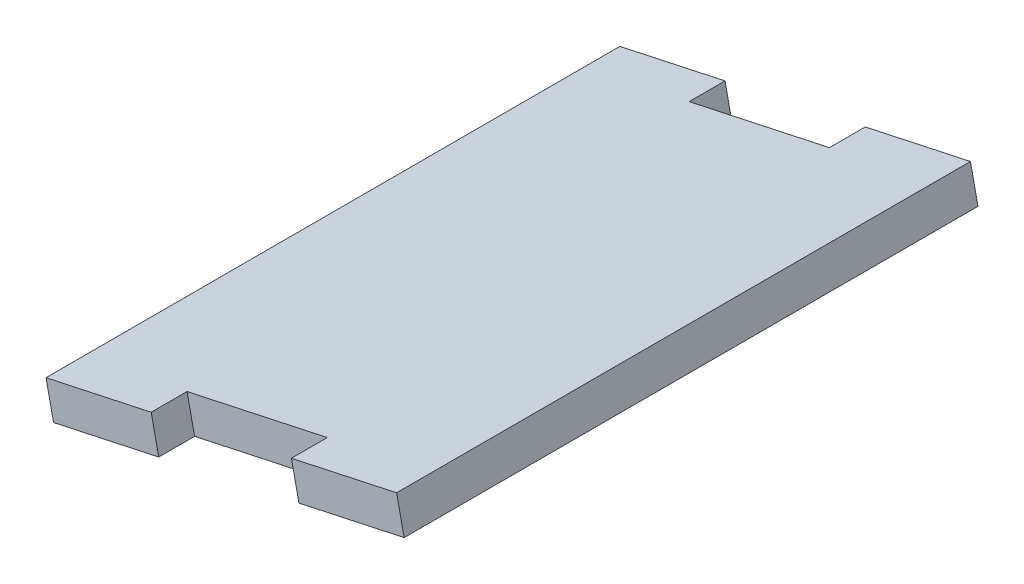
ISO-10303-21;
HEADER;
FILE_DESCRIPTION(('STEP AP214'),'2;1');
FILE_NAME('part.step','',(''),(''),'','','');
FILE_SCHEMA(('AUTOMOTIVE_DESIGN { 1 0 10303 214 1 1 1 1 }'));
ENDSEC;
DATA;
#1=APPLICATION_CONTEXT('core data for automotive mechanical design processes');
#2=APPLICATION_PROTOCOL_DEFINITION('international standard','automotive_design',2000,#1);
#3=PRODUCT_CONTEXT('',#1,'mechanical');
#4=PRODUCT('Part','Part','',(#3));
#5=PRODUCT_RELATED_PRODUCT_CATEGORY('part','',(#4));
#6=PRODUCT_DEFINITION_FORMATION('','',#4);
#7=PRODUCT_DEFINITION_CONTEXT('part definition',#1,'design');
#8=PRODUCT_DEFINITION('design','',#6,#7);
#9=PRODUCT_DEFINITION_SHAPE('','',#8);
#10=(LENGTH_UNIT() NAMED_UNIT(*) SI_UNIT(.MILLI.,.METRE.));
#11=(NAMED_UNIT(*) PLANE_ANGLE_UNIT() SI_UNIT($,.RADIAN.));
#12=(NAMED_UNIT(*) SI_UNIT($,.STERADIAN.) SOLID_ANGLE_UNIT());
#13=UNCERTAINTY_MEASURE_WITH_UNIT(LENGTH_MEASURE(1.E-05),#10,'distance_accuracy_value','');
#14=(GEOMETRIC_REPRESENTATION_CONTEXT(3) GLOBAL_UNCERTAINTY_ASSIGNED_CONTEXT((#13)) GLOBAL_UNIT_ASSIGNED_CONTEXT((#10,
#11,#12)) REPRESENTATION_CONTEXT('',''));
#15=CARTESIAN_POINT('',(0.,0.,0.));
#16=DIRECTION('',(0.,0.,1.));
#17=DIRECTION('',(1.,0.,0.));
#18=AXIS2_PLACEMENT_3D('',#15,#16,#17);
#19=CARTESIAN_POINT('',(0.,0.,0.));
#20=DIRECTION('',(0.,0.,1.));
#21=DIRECTION('',(1.,0.,0.));
#22=AXIS2_PLACEMENT_3D('',#19,#20,#21);
#23=PLANE('',#22);
#24=DIRECTION('',(-0.210873146354421,0.977513435276767,0.));
#25=VECTOR('',#24,1.);
#26=CARTESIAN_POINT('',(49.5443038822624,293.396684140525,0.));
#27=LINE('',#26,#25);
#28=CARTESIAN_POINT('',(49.5443038822624,293.396684140525,0.));
#29=VERTEX_POINT('',#28);
#30=CARTESIAN_POINT('',(48.8747816425871,296.500289297529,0.));
#31=VERTEX_POINT('',#30);
#32=EDGE_CURVE('E124',#29,#31,#27,.T.);
#33=ORIENTED_EDGE('',*,*,#32,.T.);
#34=DIRECTION('',(-0.977513435276767,-0.210873146354421,0.));
#35=VECTOR('',#34,1.);
#36=CARTESIAN_POINT('',(70.6000177416132,301.186944975256,0.));
#37=LINE('',#36,#35);
#38=CARTESIAN_POINT('',(39.5639661715759,294.491722578503,0.));
#39=VERTEX_POINT('',#38);
#40=EDGE_CURVE('E151',#31,#39,#37,.T.);
#41=ORIENTED_EDGE('',*,*,#40,.T.);
#42=DIRECTION('',(0.21087314635442,-0.977513435276768,0.));
#43=VECTOR('',#42,1.);
#44=CARTESIAN_POINT('',(39.5639661715759,294.491722578503,0.));
#45=LINE('',#44,#43);
#46=CARTESIAN_POINT('',(40.2334884112512,291.388117421499,0.));
#47=VERTEX_POINT('',#46);
#48=EDGE_CURVE('E146',#39,#47,#45,.T.);
#49=ORIENTED_EDGE('',*,*,#48,.T.);
#50=DIRECTION('',(0.977513435276767,0.21087314635442,0.));
#51=VECTOR('',#50,1.);
#52=CARTESIAN_POINT('',(40.2334884112512,291.388117421499,0.));
#53=LINE('',#52,#51);
#54=EDGE_CURVE('E140',#47,#29,#53,.T.);
#55=ORIENTED_EDGE('',*,*,#54,.T.);
#56=EDGE_LOOP('',(#33,#41,#49,#55));
#57=FACE_BOUND('',#56,.T.);
#58=ADVANCED_FACE('F33',(#57),#23,.T.);
#59=CARTESIAN_POINT('',(0.,0.,-50.8));
#60=DIRECTION('',(0.,0.,1.));
#61=DIRECTION('',(1.,0.,0.));
#62=AXIS2_PLACEMENT_3D('',#59,#60,#61);
#63=PLANE('',#62);
#64=DIRECTION('',(-0.977513435276767,-0.210873146354421,0.));
#65=VECTOR('',#64,1.);
#66=CARTESIAN_POINT('',(70.6000177416132,301.186944975256,-50.8));
#67=LINE('',#66,#65);
#68=CARTESIAN_POINT('',(48.8747816425871,296.500289297529,-50.8));
#69=VERTEX_POINT('',#68);
#70=CARTESIAN_POINT('',(39.5639661715759,294.491722578503,-50.8));
#71=VERTEX_POINT('',#70);
#72=EDGE_CURVE('E169',#69,#71,#67,.T.);
#73=ORIENTED_EDGE('',*,*,#72,.F.);
#74=DIRECTION('',(-0.210873146354421,0.977513435276767,0.));
#75=VECTOR('',#74,1.);
#76=CARTESIAN_POINT('',(49.5443038822624,293.396684140525,-50.8));
#77=LINE('',#76,#75);
#78=CARTESIAN_POINT('',(49.5443038822624,293.396684140525,-50.8));
#79=VERTEX_POINT('',#78);
#80=EDGE_CURVE('E188',#79,#69,#77,.T.);
#81=ORIENTED_EDGE('',*,*,#80,.F.);
#82=DIRECTION('',(0.977513435276767,0.21087314635442,0.));
#83=VECTOR('',#82,1.);
#84=CARTESIAN_POINT('',(40.2334884112512,291.388117421499,-50.8));
#85=LINE('',#84,#83);
#86=CARTESIAN_POINT('',(40.2334884112512,291.388117421499,-50.8));
#87=VERTEX_POINT('',#86);
#88=EDGE_CURVE('E176',#87,#79,#85,.T.);
#89=ORIENTED_EDGE('',*,*,#88,.F.);
#90=DIRECTION('',(0.21087314635442,-0.977513435276768,0.));
#91=VECTOR('',#90,1.);
#92=CARTESIAN_POINT('',(39.5639661715759,294.491722578503,-50.8));
#93=LINE('',#92,#91);
#94=EDGE_CURVE('E158',#71,#87,#93,.T.);
#95=ORIENTED_EDGE('',*,*,#94,.F.);
#96=EDGE_LOOP('',(#73,#81,#89,#95));
#97=FACE_BOUND('',#96,.T.);
#98=ADVANCED_FACE('F236',(#97),#63,.F.);
#99=CARTESIAN_POINT('',(39.5639661715759,294.491722578503,-50.8));
#100=DIRECTION('',(-0.977513435276768,-0.21087314635442,0.));
#101=DIRECTION('',(0.21087314635442,-0.977513435276768,0.));
#102=AXIS2_PLACEMENT_3D('',#99,#100,#101);
#103=PLANE('',#102);
#104=ORIENTED_EDGE('',*,*,#48,.F.);
#105=DIRECTION('',(0.,0.,1.));
#106=VECTOR('',#105,1.);
#107=CARTESIAN_POINT('',(39.5639661715759,294.491722578503,-50.8));
#108=LINE('',#107,#106);
#109=EDGE_CURVE('E11',#71,#39,#108,.T.);
#110=ORIENTED_EDGE('',*,*,#109,.F.);
#111=ORIENTED_EDGE('',*,*,#94,.T.);
#112=DIRECTION('',(0.,0.,1.));
#113=VECTOR('',#112,1.);
#114=CARTESIAN_POINT('',(40.2334884112512,291.388117421499,-50.8));
#115=LINE('',#114,#113);
#116=EDGE_CURVE('E37',#87,#47,#115,.T.);
#117=ORIENTED_EDGE('',*,*,#116,.T.);
#118=EDGE_LOOP('',(#104,#110,#111,#117));
#119=FACE_BOUND('',#118,.T.);
#120=ADVANCED_FACE('F35',(#119),#103,.T.);
#121=CARTESIAN_POINT('',(70.6000177416132,301.186944975256,-50.8));
#122=DIRECTION('',(-0.210873146354421,0.977513435276767,0.));
#123=DIRECTION('',(-0.977513435276767,-0.210873146354421,0.));
#124=AXIS2_PLACEMENT_3D('',#121,#122,#123);
#125=PLANE('',#124);
#126=DIRECTION('',(0.,0.,1.));
#127=VECTOR('',#126,1.);
#128=CARTESIAN_POINT('',(48.8747816425871,296.500289297529,0.));
#129=LINE('',#128,#127);
#130=CARTESIAN_POINT('',(48.8747816425871,296.500289297529,-3.17499999999998));
#131=VERTEX_POINT('',#130);
#132=EDGE_CURVE('E130',#131,#31,#129,.T.);
#133=ORIENTED_EDGE('',*,*,#132,.F.);
#134=DIRECTION('',(-0.977513435276767,-0.210873146354421,0.));
#135=VECTOR('',#134,1.);
#136=CARTESIAN_POINT('',(48.8747816425871,296.500289297529,-3.17499999999998));
#137=LINE('',#136,#135);
#138=CARTESIAN_POINT('',(61.289202270602,299.17837825623,-3.17499999999998));
#139=VERTEX_POINT('',#138);
#140=EDGE_CURVE('E143',#139,#131,#137,.T.);
#141=ORIENTED_EDGE('',*,*,#140,.F.);
#142=DIRECTION('',(0.,0.,-1.));
#143=VECTOR('',#142,1.);
#144=CARTESIAN_POINT('',(61.289202270602,299.17837825623,0.));
#145=LINE('',#144,#143);
#146=CARTESIAN_POINT('',(61.289202270602,299.17837825623,0.));
#147=VERTEX_POINT('',#146);
#148=EDGE_CURVE('E212',#147,#139,#145,.T.);
#149=ORIENTED_EDGE('',*,*,#148,.F.);
#150=CARTESIAN_POINT('',(70.6000177416132,301.186944975256,0.));
#151=VERTEX_POINT('',#150);
#152=EDGE_CURVE('E156',#151,#147,#37,.T.);
#153=ORIENTED_EDGE('',*,*,#152,.F.);
#154=DIRECTION('',(0.,0.,1.));
#155=VECTOR('',#154,1.);
#156=CARTESIAN_POINT('',(70.6000177416132,301.186944975256,-50.8));
#157=LINE('',#156,#155);
#158=CARTESIAN_POINT('',(70.6000177416132,301.186944975256,-50.8));
#159=VERTEX_POINT('',#158);
#160=EDGE_CURVE('E42',#159,#151,#157,.T.);
#161=ORIENTED_EDGE('',*,*,#160,.F.);
#162=CARTESIAN_POINT('',(61.289202270602,299.17837825623,-50.8));
#163=VERTEX_POINT('',#162);
#164=EDGE_CURVE('E165',#159,#163,#67,.T.);
#165=ORIENTED_EDGE('',*,*,#164,.T.);
#166=DIRECTION('',(0.,0.,-1.));
#167=VECTOR('',#166,1.);
#168=CARTESIAN_POINT('',(61.289202270602,299.17837825623,-50.8));
#169=LINE('',#168,#167);
#170=CARTESIAN_POINT('',(61.289202270602,299.17837825623,-47.625));
#171=VERTEX_POINT('',#170);
#172=EDGE_CURVE('E58',#171,#163,#169,.T.);
#173=ORIENTED_EDGE('',*,*,#172,.F.);
#174=DIRECTION('',(0.977513435276767,0.210873146354421,0.));
#175=VECTOR('',#174,1.);
#176=CARTESIAN_POINT('',(48.8747816425871,296.500289297529,-47.625));
#177=LINE('',#176,#175);
#178=CARTESIAN_POINT('',(48.8747816425871,296.500289297529,-47.625));
#179=VERTEX_POINT('',#178);
#180=EDGE_CURVE('E192',#179,#171,#177,.T.);
#181=ORIENTED_EDGE('',*,*,#180,.F.);
#182=DIRECTION('',(0.,0.,1.));
#183=VECTOR('',#182,1.);
#184=CARTESIAN_POINT('',(48.8747816425871,296.500289297529,-50.8));
#185=LINE('',#184,#183);
#186=EDGE_CURVE('E195',#69,#179,#185,.T.);
#187=ORIENTED_EDGE('',*,*,#186,.F.);
#188=ORIENTED_EDGE('',*,*,#72,.T.);
#189=ORIENTED_EDGE('',*,*,#109,.T.);
#190=ORIENTED_EDGE('',*,*,#40,.F.);
#191=EDGE_LOOP('',(#133,#141,#149,#153,#161,#165,#173,#181,#187,#188,#189,#190));
#192=FACE_BOUND('',#191,.T.);
#193=ADVANCED_FACE('F223',(#192),#125,.T.);
#194=CARTESIAN_POINT('',(71.2695399812885,298.083339818252,-50.8));
#195=DIRECTION('',(0.977513435276767,0.210873146354424,0.));
#196=DIRECTION('',(-0.210873146354424,0.977513435276767,0.));
#197=AXIS2_PLACEMENT_3D('',#194,#195,#196);
#198=PLANE('',#197);
#199=DIRECTION('',(-0.210873146354424,0.977513435276767,0.));
#200=VECTOR('',#199,1.);
#201=CARTESIAN_POINT('',(71.2695399812885,298.083339818252,0.));
#202=LINE('',#201,#200);
#203=CARTESIAN_POINT('',(71.2695399812885,298.083339818252,0.));
#204=VERTEX_POINT('',#203);
#205=EDGE_CURVE('E147',#204,#151,#202,.T.);
#206=ORIENTED_EDGE('',*,*,#205,.F.);
#207=DIRECTION('',(0.,0.,1.));
#208=VECTOR('',#207,1.);
#209=CARTESIAN_POINT('',(71.2695399812885,298.083339818252,-50.8));
#210=LINE('',#209,#208);
#211=CARTESIAN_POINT('',(71.2695399812885,298.083339818252,-50.8));
#212=VERTEX_POINT('',#211);
#213=EDGE_CURVE('E160',#212,#204,#210,.T.);
#214=ORIENTED_EDGE('',*,*,#213,.F.);
#215=DIRECTION('',(-0.210873146354424,0.977513435276767,0.));
#216=VECTOR('',#215,1.);
#217=CARTESIAN_POINT('',(71.2695399812885,298.083339818252,-50.8));
#218=LINE('',#217,#216);
#219=EDGE_CURVE('E172',#212,#159,#218,.T.);
#220=ORIENTED_EDGE('',*,*,#219,.T.);
#221=ORIENTED_EDGE('',*,*,#160,.T.);
#222=EDGE_LOOP('',(#206,#214,#220,#221));
#223=FACE_BOUND('',#222,.T.);
#224=ADVANCED_FACE('F258',(#223),#198,.T.);
#225=CARTESIAN_POINT('',(40.2334884112512,291.388117421499,-50.8));
#226=DIRECTION('',(0.21087314635442,-0.977513435276767,0.));
#227=DIRECTION('',(0.977513435276768,0.210873146354421,0.));
#228=AXIS2_PLACEMENT_3D('',#225,#226,#227);
#229=PLANE('',#228);
#230=DIRECTION('',(0.,0.,1.));
#231=VECTOR('',#230,1.);
#232=CARTESIAN_POINT('',(49.5443038822624,293.396684140525,0.));
#233=LINE('',#232,#231);
#234=CARTESIAN_POINT('',(49.5443038822624,293.396684140525,-3.17499999999998));
#235=VERTEX_POINT('',#234);
#236=EDGE_CURVE('E127',#235,#29,#233,.T.);
#237=ORIENTED_EDGE('',*,*,#236,.T.);
#238=ORIENTED_EDGE('',*,*,#54,.F.);
#239=ORIENTED_EDGE('',*,*,#116,.F.);
#240=ORIENTED_EDGE('',*,*,#88,.T.);
#241=DIRECTION('',(0.,0.,1.));
#242=VECTOR('',#241,1.);
#243=CARTESIAN_POINT('',(49.5443038822624,293.396684140525,-50.8));
#244=LINE('',#243,#242);
#245=CARTESIAN_POINT('',(49.5443038822624,293.396684140525,-47.625));
#246=VERTEX_POINT('',#245);
#247=EDGE_CURVE('E191',#79,#246,#244,.T.);
#248=ORIENTED_EDGE('',*,*,#247,.T.);
#249=DIRECTION('',(0.977513435276767,0.210873146354421,0.));
#250=VECTOR('',#249,1.);
#251=CARTESIAN_POINT('',(49.5443038822624,293.396684140525,-47.625));
#252=LINE('',#251,#250);
#253=CARTESIAN_POINT('',(61.9587245102773,296.074773099226,-47.625));
#254=VERTEX_POINT('',#253);
#255=EDGE_CURVE('E201',#246,#254,#252,.T.);
#256=ORIENTED_EDGE('',*,*,#255,.T.);
#257=DIRECTION('',(0.,0.,-1.));
#258=VECTOR('',#257,1.);
#259=CARTESIAN_POINT('',(61.9587245102773,296.074773099226,-50.8));
#260=LINE('',#259,#258);
#261=CARTESIAN_POINT('',(61.9587245102773,296.074773099226,-50.8));
#262=VERTEX_POINT('',#261);
#263=EDGE_CURVE('E184',#254,#262,#260,.T.);
#264=ORIENTED_EDGE('',*,*,#263,.T.);
#265=EDGE_CURVE('E179',#262,#212,#85,.T.);
#266=ORIENTED_EDGE('',*,*,#265,.T.);
#267=ORIENTED_EDGE('',*,*,#213,.T.);
#268=CARTESIAN_POINT('',(61.9587245102773,296.074773099226,0.));
#269=VERTEX_POINT('',#268);
#270=EDGE_CURVE('E148',#269,#204,#53,.T.);
#271=ORIENTED_EDGE('',*,*,#270,.F.);
#272=DIRECTION('',(0.,0.,-1.));
#273=VECTOR('',#272,1.);
#274=CARTESIAN_POINT('',(61.9587245102773,296.074773099226,0.));
#275=LINE('',#274,#273);
#276=CARTESIAN_POINT('',(61.9587245102773,296.074773099226,-3.17499999999998));
#277=VERTEX_POINT('',#276);
#278=EDGE_CURVE('E50',#269,#277,#275,.T.);
#279=ORIENTED_EDGE('',*,*,#278,.T.);
#280=DIRECTION('',(-0.977513435276767,-0.210873146354421,0.));
#281=VECTOR('',#280,1.);
#282=CARTESIAN_POINT('',(49.5443038822624,293.396684140525,-3.17499999999998));
#283=LINE('',#282,#281);
#284=EDGE_CURVE('E135',#277,#235,#283,.T.);
#285=ORIENTED_EDGE('',*,*,#284,.T.);
#286=EDGE_LOOP('',(#237,#238,#239,#240,#248,#256,#264,#266,#267,#271,#279,#285));
#287=FACE_BOUND('',#286,.T.);
#288=ADVANCED_FACE('F139',(#287),#229,.T.);
#289=ORIENTED_EDGE('',*,*,#265,.F.);
#290=DIRECTION('',(-0.210873146354421,0.977513435276767,0.));
#291=VECTOR('',#290,1.);
#292=CARTESIAN_POINT('',(61.9587245102773,296.074773099226,-50.8));
#293=LINE('',#292,#291);
#294=EDGE_CURVE('E186',#262,#163,#293,.T.);
#295=ORIENTED_EDGE('',*,*,#294,.T.);
#296=ORIENTED_EDGE('',*,*,#164,.F.);
#297=ORIENTED_EDGE('',*,*,#219,.F.);
#298=EDGE_LOOP('',(#289,#295,#296,#297));
#299=FACE_BOUND('',#298,.T.);
#300=ADVANCED_FACE('F243',(#299),#63,.F.);
#301=DIRECTION('',(-0.210873146354421,0.977513435276767,0.));
#302=VECTOR('',#301,1.);
#303=CARTESIAN_POINT('',(61.9587245102773,296.074773099226,0.));
#304=LINE('',#303,#302);
#305=EDGE_CURVE('E134',#269,#147,#304,.T.);
#306=ORIENTED_EDGE('',*,*,#305,.F.);
#307=ORIENTED_EDGE('',*,*,#270,.T.);
#308=ORIENTED_EDGE('',*,*,#205,.T.);
#309=ORIENTED_EDGE('',*,*,#152,.T.);
#310=EDGE_LOOP('',(#306,#307,#308,#309));
#311=FACE_BOUND('',#310,.T.);
#312=ADVANCED_FACE('F218',(#311),#23,.T.);
#313=CARTESIAN_POINT('',(49.5443038822624,293.396684140525,-50.8));
#314=DIRECTION('',(-0.977513435276767,-0.210873146354421,0.));
#315=DIRECTION('',(0.210873146354421,-0.977513435276767,0.));
#316=AXIS2_PLACEMENT_3D('',#313,#314,#315);
#317=PLANE('',#316);
#318=ORIENTED_EDGE('',*,*,#186,.T.);
#319=DIRECTION('',(-0.210873146354421,0.977513435276767,0.));
#320=VECTOR('',#319,1.);
#321=CARTESIAN_POINT('',(49.5443038822624,293.396684140525,-47.625));
#322=LINE('',#321,#320);
#323=EDGE_CURVE('E181',#246,#179,#322,.T.);
#324=ORIENTED_EDGE('',*,*,#323,.F.);
#325=ORIENTED_EDGE('',*,*,#247,.F.);
#326=ORIENTED_EDGE('',*,*,#80,.T.);
#327=EDGE_LOOP('',(#318,#324,#325,#326));
#328=FACE_BOUND('',#327,.T.);
#329=ADVANCED_FACE('F246',(#328),#317,.F.);
#330=CARTESIAN_POINT('',(61.9587245102773,296.074773099226,-50.8));
#331=DIRECTION('',(0.977513435276767,0.210873146354421,0.));
#332=DIRECTION('',(-0.210873146354421,0.977513435276767,0.));
#333=AXIS2_PLACEMENT_3D('',#330,#331,#332);
#334=PLANE('',#333);
#335=ORIENTED_EDGE('',*,*,#172,.T.);
#336=ORIENTED_EDGE('',*,*,#294,.F.);
#337=ORIENTED_EDGE('',*,*,#263,.F.);
#338=DIRECTION('',(-0.210873146354421,0.977513435276767,0.));
#339=VECTOR('',#338,1.);
#340=CARTESIAN_POINT('',(61.9587245102773,296.074773099226,-47.625));
#341=LINE('',#340,#339);
#342=EDGE_CURVE('E183',#254,#171,#341,.T.);
#343=ORIENTED_EDGE('',*,*,#342,.T.);
#344=EDGE_LOOP('',(#335,#336,#337,#343));
#345=FACE_BOUND('',#344,.T.);
#346=ADVANCED_FACE('F251',(#345),#334,.F.);
#347=CARTESIAN_POINT('',(49.5443038822624,293.396684140525,-47.625));
#348=DIRECTION('',(0.,0.,1.));
#349=DIRECTION('',(1.,0.,0.));
#350=AXIS2_PLACEMENT_3D('',#347,#348,#349);
#351=PLANE('',#350);
#352=ORIENTED_EDGE('',*,*,#180,.T.);
#353=ORIENTED_EDGE('',*,*,#342,.F.);
#354=ORIENTED_EDGE('',*,*,#255,.F.);
#355=ORIENTED_EDGE('',*,*,#323,.T.);
#356=EDGE_LOOP('',(#352,#353,#354,#355));
#357=FACE_BOUND('',#356,.T.);
#358=ADVANCED_FACE('F233',(#357),#351,.F.);
#359=CARTESIAN_POINT('',(49.5443038822624,293.396684140525,0.));
#360=DIRECTION('',(-0.977513435276767,-0.210873146354421,0.));
#361=DIRECTION('',(0.210873146354421,-0.977513435276767,0.));
#362=AXIS2_PLACEMENT_3D('',#359,#360,#361);
#363=PLANE('',#362);
#364=ORIENTED_EDGE('',*,*,#132,.T.);
#365=ORIENTED_EDGE('',*,*,#32,.F.);
#366=ORIENTED_EDGE('',*,*,#236,.F.);
#367=DIRECTION('',(-0.210873146354421,0.977513435276767,0.));
#368=VECTOR('',#367,1.);
#369=CARTESIAN_POINT('',(49.5443038822624,293.396684140525,-3.17499999999998));
#370=LINE('',#369,#368);
#371=EDGE_CURVE('E198',#235,#131,#370,.T.);
#372=ORIENTED_EDGE('',*,*,#371,.T.);
#373=EDGE_LOOP('',(#364,#365,#366,#372));
#374=FACE_BOUND('',#373,.T.);
#375=ADVANCED_FACE('F126',(#374),#363,.F.);
#376=CARTESIAN_POINT('',(49.5443038822624,293.396684140525,-3.17499999999998));
#377=DIRECTION('',(0.,0.,-1.));
#378=DIRECTION('',(-1.,0.,0.));
#379=AXIS2_PLACEMENT_3D('',#376,#377,#378);
#380=PLANE('',#379);
#381=ORIENTED_EDGE('',*,*,#140,.T.);
#382=ORIENTED_EDGE('',*,*,#371,.F.);
#383=ORIENTED_EDGE('',*,*,#284,.F.);
#384=DIRECTION('',(-0.210873146354421,0.977513435276767,0.));
#385=VECTOR('',#384,1.);
#386=CARTESIAN_POINT('',(61.9587245102773,296.074773099226,-3.17499999999998));
#387=LINE('',#386,#385);
#388=EDGE_CURVE('E207',#277,#139,#387,.T.);
#389=ORIENTED_EDGE('',*,*,#388,.T.);
#390=EDGE_LOOP('',(#381,#382,#383,#389));
#391=FACE_BOUND('',#390,.T.);
#392=ADVANCED_FACE('F225',(#391),#380,.F.);
#393=CARTESIAN_POINT('',(61.9587245102773,296.074773099226,0.));
#394=DIRECTION('',(0.977513435276767,0.210873146354421,0.));
#395=DIRECTION('',(-0.210873146354421,0.977513435276767,0.));
#396=AXIS2_PLACEMENT_3D('',#393,#394,#395);
#397=PLANE('',#396);
#398=ORIENTED_EDGE('',*,*,#148,.T.);
#399=ORIENTED_EDGE('',*,*,#388,.F.);
#400=ORIENTED_EDGE('',*,*,#278,.F.);
#401=ORIENTED_EDGE('',*,*,#305,.T.);
#402=EDGE_LOOP('',(#398,#399,#400,#401));
#403=FACE_BOUND('',#402,.T.);
#404=ADVANCED_FACE('F221',(#403),#397,.F.);
#405=CLOSED_SHELL('',(#58,#98,#120,#193,#224,#288,#300,#312,#329,#346,#358,#375,#392,#404));
#406=MANIFOLD_SOLID_BREP('B2',#405);
#407=ADVANCED_BREP_SHAPE_REPRESENTATION('',(#18,#406),#14);
#408=SHAPE_DEFINITION_REPRESENTATION(#9,#407);
ENDSEC;
END-ISO-10303-21;
